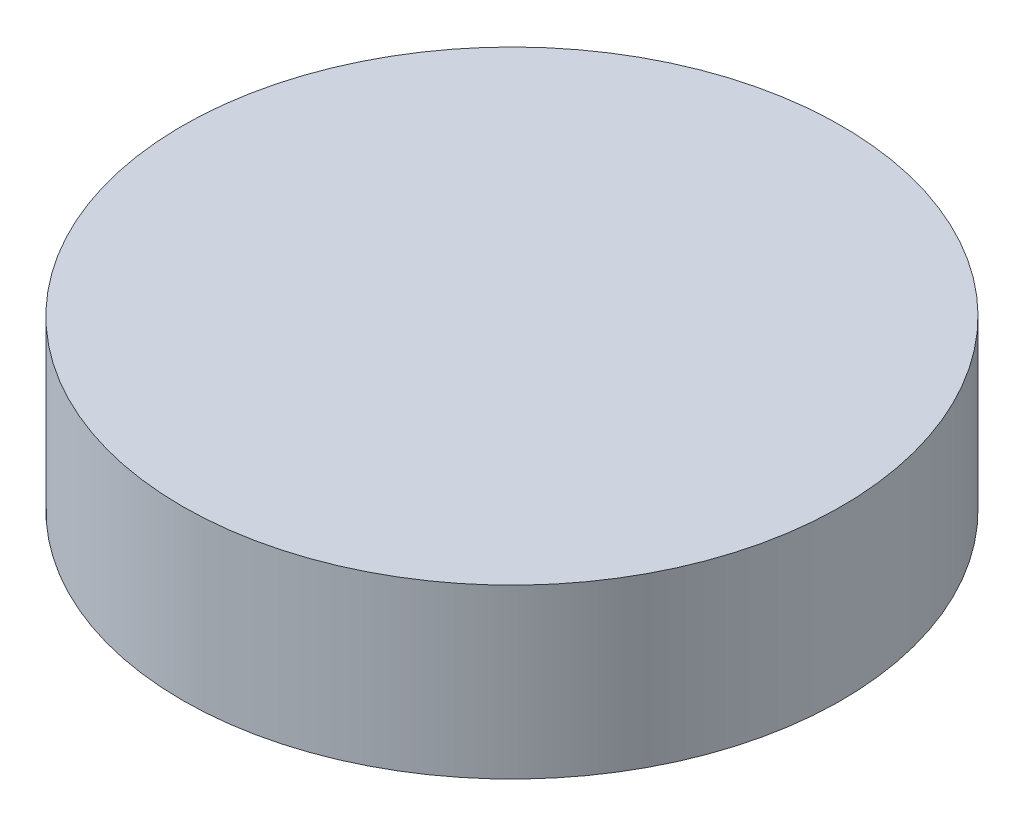
ISO-10303-21;
HEADER;
FILE_DESCRIPTION(('STEP AP214'),'2;1');
FILE_NAME('part.step','',(''),(''),'','','');
FILE_SCHEMA(('AUTOMOTIVE_DESIGN { 1 0 10303 214 1 1 1 1 }'));
ENDSEC;
DATA;
#1=APPLICATION_CONTEXT('core data for automotive mechanical design processes');
#2=APPLICATION_PROTOCOL_DEFINITION('international standard','automotive_design',2000,#1);
#3=PRODUCT_CONTEXT('',#1,'mechanical');
#4=PRODUCT('Part','Part','',(#3));
#5=PRODUCT_RELATED_PRODUCT_CATEGORY('part','',(#4));
#6=PRODUCT_DEFINITION_FORMATION('','',#4);
#7=PRODUCT_DEFINITION_CONTEXT('part definition',#1,'design');
#8=PRODUCT_DEFINITION('design','',#6,#7);
#9=PRODUCT_DEFINITION_SHAPE('','',#8);
#10=(LENGTH_UNIT() NAMED_UNIT(*) SI_UNIT(.MILLI.,.METRE.));
#11=(NAMED_UNIT(*) PLANE_ANGLE_UNIT() SI_UNIT($,.RADIAN.));
#12=(NAMED_UNIT(*) SI_UNIT($,.STERADIAN.) SOLID_ANGLE_UNIT());
#13=UNCERTAINTY_MEASURE_WITH_UNIT(LENGTH_MEASURE(1.E-05),#10,'distance_accuracy_value','');
#14=(GEOMETRIC_REPRESENTATION_CONTEXT(3) GLOBAL_UNCERTAINTY_ASSIGNED_CONTEXT((#13)) GLOBAL_UNIT_ASSIGNED_CONTEXT((#10,
#11,#12)) REPRESENTATION_CONTEXT('',''));
#15=CARTESIAN_POINT('',(0.,0.,0.));
#16=DIRECTION('',(0.,0.,1.));
#17=DIRECTION('',(1.,0.,0.));
#18=AXIS2_PLACEMENT_3D('',#15,#16,#17);
#19=CARTESIAN_POINT('',(0.,1.016,0.));
#20=DIRECTION('',(0.,-1.,0.));
#21=DIRECTION('',(0.,0.,-1.));
#22=AXIS2_PLACEMENT_3D('',#19,#20,#21);
#23=CYLINDRICAL_SURFACE('',#22,1.9939);
#24=CARTESIAN_POINT('',(0.,1.016,0.));
#25=DIRECTION('',(0.,1.,0.));
#26=DIRECTION('',(0.,0.,1.));
#27=AXIS2_PLACEMENT_3D('',#24,#25,#26);
#28=CIRCLE('',#27,1.9939);
#29=CARTESIAN_POINT('',(0.,1.016,1.9939));
#30=VERTEX_POINT('',#29);
#31=EDGE_CURVE('E10',#30,#30,#28,.T.);
#32=ORIENTED_EDGE('',*,*,#31,.F.);
#33=EDGE_LOOP('',(#32));
#34=FACE_BOUND('',#33,.T.);
#35=CARTESIAN_POINT('',(0.,0.,0.));
#36=DIRECTION('',(0.,1.,0.));
#37=DIRECTION('',(0.,0.,1.));
#38=AXIS2_PLACEMENT_3D('',#35,#36,#37);
#39=CIRCLE('',#38,1.9939);
#40=CARTESIAN_POINT('',(0.,0.,1.9939));
#41=VERTEX_POINT('',#40);
#42=EDGE_CURVE('E40',#41,#41,#39,.T.);
#43=ORIENTED_EDGE('',*,*,#42,.T.);
#44=EDGE_LOOP('',(#43));
#45=FACE_BOUND('',#44,.T.);
#46=ADVANCED_FACE('F37',(#34,#45),#23,.T.);
#47=CARTESIAN_POINT('',(0.,1.016,0.));
#48=DIRECTION('',(0.,1.,0.));
#49=DIRECTION('',(0.,0.,1.));
#50=AXIS2_PLACEMENT_3D('',#47,#48,#49);
#51=PLANE('',#50);
#52=ORIENTED_EDGE('',*,*,#31,.T.);
#53=EDGE_LOOP('',(#52));
#54=FACE_BOUND('',#53,.T.);
#55=ADVANCED_FACE('F54',(#54),#51,.T.);
#56=CARTESIAN_POINT('',(0.,0.,0.));
#57=DIRECTION('',(0.,1.,0.));
#58=DIRECTION('',(0.,0.,1.));
#59=AXIS2_PLACEMENT_3D('',#56,#57,#58);
#60=PLANE('',#59);
#61=ORIENTED_EDGE('',*,*,#42,.F.);
#62=EDGE_LOOP('',(#61));
#63=FACE_BOUND('',#62,.T.);
#64=ADVANCED_FACE('F52',(#63),#60,.F.);
#65=CLOSED_SHELL('',(#46,#55,#64));
#66=MANIFOLD_SOLID_BREP('B2',#65);
#67=ADVANCED_BREP_SHAPE_REPRESENTATION('',(#18,#66),#14);
#68=SHAPE_DEFINITION_REPRESENTATION(#9,#67);
ENDSEC;
END-ISO-10303-21;
